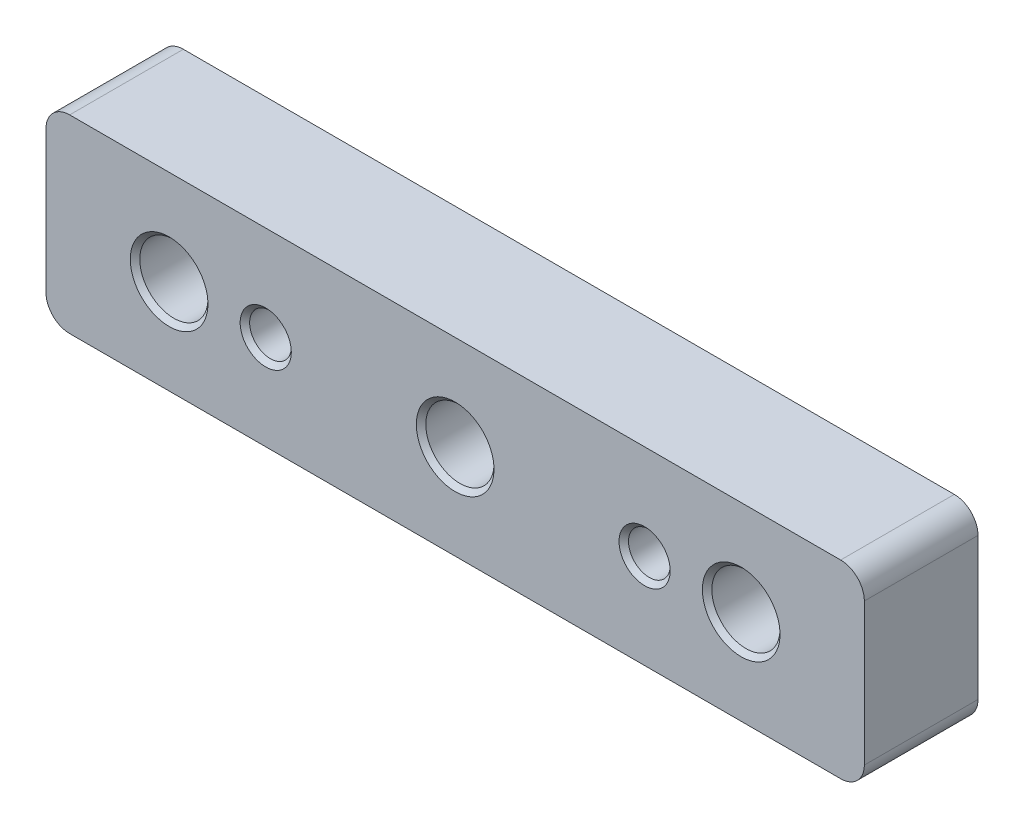
ISO-10303-21;
HEADER;
FILE_DESCRIPTION(('STEP AP214'),'2;1');
FILE_NAME('part.step','',(''),(''),'','','');
FILE_SCHEMA(('AUTOMOTIVE_DESIGN { 1 0 10303 214 1 1 1 1 }'));
ENDSEC;
DATA;
#1=APPLICATION_CONTEXT('core data for automotive mechanical design processes');
#2=APPLICATION_PROTOCOL_DEFINITION('international standard','automotive_design',2000,#1);
#3=PRODUCT_CONTEXT('',#1,'mechanical');
#4=PRODUCT('Part','Part','',(#3));
#5=PRODUCT_RELATED_PRODUCT_CATEGORY('part','',(#4));
#6=PRODUCT_DEFINITION_FORMATION('','',#4);
#7=PRODUCT_DEFINITION_CONTEXT('part definition',#1,'design');
#8=PRODUCT_DEFINITION('design','',#6,#7);
#9=PRODUCT_DEFINITION_SHAPE('','',#8);
#10=(LENGTH_UNIT() NAMED_UNIT(*) SI_UNIT(.MILLI.,.METRE.));
#11=(NAMED_UNIT(*) PLANE_ANGLE_UNIT() SI_UNIT($,.RADIAN.));
#12=(NAMED_UNIT(*) SI_UNIT($,.STERADIAN.) SOLID_ANGLE_UNIT());
#13=UNCERTAINTY_MEASURE_WITH_UNIT(LENGTH_MEASURE(1.E-05),#10,'distance_accuracy_value','');
#14=(GEOMETRIC_REPRESENTATION_CONTEXT(3) GLOBAL_UNCERTAINTY_ASSIGNED_CONTEXT((#13)) GLOBAL_UNIT_ASSIGNED_CONTEXT((#10,
#11,#12)) REPRESENTATION_CONTEXT('',''));
#15=CARTESIAN_POINT('',(0.,0.,0.));
#16=DIRECTION('',(0.,0.,1.));
#17=DIRECTION('',(1.,0.,0.));
#18=AXIS2_PLACEMENT_3D('',#15,#16,#17);
#19=CARTESIAN_POINT('',(39.1232060070326,9.9696844118921,5.10751094142825));
#20=DIRECTION('',(0.,0.,-1.));
#21=DIRECTION('',(-1.,0.,0.));
#22=AXIS2_PLACEMENT_3D('',#19,#20,#21);
#23=PLANE('',#22);
#24=CARTESIAN_POINT('',(28.6232060070326,2.4696844118921,5.10751094142825));
#25=DIRECTION('',(0.,0.,-1.));
#26=DIRECTION('',(-1.,0.,0.));
#27=AXIS2_PLACEMENT_3D('',#24,#25,#26);
#28=CIRCLE('',#27,4.10000000000002);
#29=CARTESIAN_POINT('',(24.5232060070326,2.4696844118921,5.10751094142825));
#30=VERTEX_POINT('',#29);
#31=EDGE_CURVE('E10',#30,#30,#28,.T.);
#32=ORIENTED_EDGE('',*,*,#31,.T.);
#33=EDGE_LOOP('',(#32));
#34=FACE_BOUND('',#33,.T.);
#35=CARTESIAN_POINT('',(-1.5767939929674,2.4696844118921,5.10751094142825));
#36=DIRECTION('',(0.,0.,-1.));
#37=DIRECTION('',(-1.,0.,0.));
#38=AXIS2_PLACEMENT_3D('',#35,#36,#37);
#39=CIRCLE('',#38,4.10000000000002);
#40=CARTESIAN_POINT('',(-5.67679399296742,2.4696844118921,5.10751094142825));
#41=VERTEX_POINT('',#40);
#42=EDGE_CURVE('E25',#41,#41,#39,.T.);
#43=ORIENTED_EDGE('',*,*,#42,.T.);
#44=EDGE_LOOP('',(#43));
#45=FACE_BOUND('',#44,.T.);
#46=CARTESIAN_POINT('',(-31.7767939929674,2.4696844118921,5.10751094142825));
#47=DIRECTION('',(0.,0.,-1.));
#48=DIRECTION('',(-1.,0.,0.));
#49=AXIS2_PLACEMENT_3D('',#46,#47,#48);
#50=CIRCLE('',#49,4.10000000000002);
#51=CARTESIAN_POINT('',(-35.8767939929674,2.4696844118921,5.10751094142825));
#52=VERTEX_POINT('',#51);
#53=EDGE_CURVE('E182',#52,#52,#50,.T.);
#54=ORIENTED_EDGE('',*,*,#53,.T.);
#55=EDGE_LOOP('',(#54));
#56=FACE_BOUND('',#55,.T.);
#57=CARTESIAN_POINT('',(-21.5767939929674,2.4696844118921,5.10751094142825));
#58=DIRECTION('',(0.,0.,1.));
#59=DIRECTION('',(1.,0.,0.));
#60=AXIS2_PLACEMENT_3D('',#57,#58,#59);
#61=CIRCLE('',#60,2.7);
#62=CARTESIAN_POINT('',(-18.8767939929674,2.4696844118921,5.10751094142825));
#63=VERTEX_POINT('',#62);
#64=EDGE_CURVE('E478',#63,#63,#61,.T.);
#65=ORIENTED_EDGE('',*,*,#64,.F.);
#66=EDGE_LOOP('',(#65));
#67=FACE_BOUND('',#66,.T.);
#68=CARTESIAN_POINT('',(18.4232060070326,2.4696844118921,5.10751094142825));
#69=DIRECTION('',(0.,0.,1.));
#70=DIRECTION('',(1.,0.,0.));
#71=AXIS2_PLACEMENT_3D('',#68,#69,#70);
#72=CIRCLE('',#71,2.7);
#73=CARTESIAN_POINT('',(21.1232060070326,2.4696844118921,5.10751094142825));
#74=VERTEX_POINT('',#73);
#75=EDGE_CURVE('E453',#74,#74,#72,.T.);
#76=ORIENTED_EDGE('',*,*,#75,.F.);
#77=EDGE_LOOP('',(#76));
#78=FACE_BOUND('',#77,.T.);
#79=CARTESIAN_POINT('',(39.1232060070326,9.9696844118921,5.10751094142825));
#80=DIRECTION('',(0.,0.,1.));
#81=DIRECTION('',(-1.,0.,0.));
#82=AXIS2_PLACEMENT_3D('',#79,#80,#81);
#83=CIRCLE('',#82,2.5);
#84=CARTESIAN_POINT('',(41.6232060070326,9.9696844118921,5.10751094142825));
#85=VERTEX_POINT('',#84);
#86=CARTESIAN_POINT('',(39.1232060070326,12.4696844118921,5.10751094142825));
#87=VERTEX_POINT('',#86);
#88=EDGE_CURVE('E128',#85,#87,#83,.T.);
#89=ORIENTED_EDGE('',*,*,#88,.T.);
#90=DIRECTION('',(-1.,0.,0.));
#91=VECTOR('',#90,1.);
#92=CARTESIAN_POINT('',(-42.2767939929674,12.4696844118921,5.10751094142825));
#93=LINE('',#92,#91);
#94=CARTESIAN_POINT('',(-42.2767939929674,12.4696844118921,5.10751094142825));
#95=VERTEX_POINT('',#94);
#96=EDGE_CURVE('E77',#87,#95,#93,.T.);
#97=ORIENTED_EDGE('',*,*,#96,.T.);
#98=CARTESIAN_POINT('',(-42.2767939929674,9.9696844118921,5.10751094142825));
#99=DIRECTION('',(0.,0.,1.));
#100=DIRECTION('',(-1.,0.,0.));
#101=AXIS2_PLACEMENT_3D('',#98,#99,#100);
#102=CIRCLE('',#101,2.5);
#103=CARTESIAN_POINT('',(-44.7767939929674,9.9696844118921,5.10751094142825));
#104=VERTEX_POINT('',#103);
#105=EDGE_CURVE('E462',#95,#104,#102,.T.);
#106=ORIENTED_EDGE('',*,*,#105,.T.);
#107=DIRECTION('',(0.,-1.,0.));
#108=VECTOR('',#107,1.);
#109=CARTESIAN_POINT('',(-44.7767939929674,9.9696844118921,5.10751094142825));
#110=LINE('',#109,#108);
#111=CARTESIAN_POINT('',(-44.7767939929674,-5.0303155881079,5.10751094142825));
#112=VERTEX_POINT('',#111);
#113=EDGE_CURVE('E464',#104,#112,#110,.T.);
#114=ORIENTED_EDGE('',*,*,#113,.T.);
#115=CARTESIAN_POINT('',(-42.2767939929674,-5.0303155881079,5.10751094142825));
#116=DIRECTION('',(0.,0.,1.));
#117=DIRECTION('',(-1.,0.,0.));
#118=AXIS2_PLACEMENT_3D('',#115,#116,#117);
#119=CIRCLE('',#118,2.5);
#120=CARTESIAN_POINT('',(-42.2767939929674,-7.5303155881079,5.10751094142825));
#121=VERTEX_POINT('',#120);
#122=EDGE_CURVE('E95',#112,#121,#119,.T.);
#123=ORIENTED_EDGE('',*,*,#122,.T.);
#124=DIRECTION('',(1.,0.,0.));
#125=VECTOR('',#124,1.);
#126=CARTESIAN_POINT('',(-42.2767939929674,-7.5303155881079,5.10751094142825));
#127=LINE('',#126,#125);
#128=CARTESIAN_POINT('',(39.1232060070326,-7.5303155881079,5.10751094142825));
#129=VERTEX_POINT('',#128);
#130=EDGE_CURVE('E90',#121,#129,#127,.T.);
#131=ORIENTED_EDGE('',*,*,#130,.T.);
#132=CARTESIAN_POINT('',(39.1232060070326,-5.0303155881079,5.10751094142825));
#133=DIRECTION('',(0.,0.,1.));
#134=DIRECTION('',(-1.,0.,0.));
#135=AXIS2_PLACEMENT_3D('',#132,#133,#134);
#136=CIRCLE('',#135,2.5);
#137=CARTESIAN_POINT('',(41.6232060070326,-5.03031558810789,5.10751094142825));
#138=VERTEX_POINT('',#137);
#139=EDGE_CURVE('E93',#129,#138,#136,.T.);
#140=ORIENTED_EDGE('',*,*,#139,.T.);
#141=DIRECTION('',(0.,1.,0.));
#142=VECTOR('',#141,1.);
#143=CARTESIAN_POINT('',(41.6232060070326,9.9696844118921,5.10751094142825));
#144=LINE('',#143,#142);
#145=EDGE_CURVE('E33',#138,#85,#144,.T.);
#146=ORIENTED_EDGE('',*,*,#145,.T.);
#147=EDGE_LOOP('',(#89,#97,#106,#114,#123,#131,#140,#146));
#148=FACE_BOUND('',#147,.T.);
#149=ADVANCED_FACE('F16',(#34,#45,#56,#67,#78,#148),#23,.F.);
#150=CARTESIAN_POINT('',(39.1232060070326,9.9696844118921,-6.89248905857175));
#151=DIRECTION('',(0.,0.,-1.));
#152=DIRECTION('',(-1.,0.,0.));
#153=AXIS2_PLACEMENT_3D('',#150,#151,#152);
#154=PLANE('',#153);
#155=CARTESIAN_POINT('',(-21.5767939929674,2.4696844118921,-6.89248905857175));
#156=DIRECTION('',(0.,0.,-1.));
#157=DIRECTION('',(-1.,0.,0.));
#158=AXIS2_PLACEMENT_3D('',#155,#156,#157);
#159=CIRCLE('',#158,2.69999999999997);
#160=CARTESIAN_POINT('',(-24.2767939929674,2.4696844118921,-6.89248905857175));
#161=VERTEX_POINT('',#160);
#162=EDGE_CURVE('E155',#161,#161,#159,.F.);
#163=ORIENTED_EDGE('',*,*,#162,.T.);
#164=EDGE_LOOP('',(#163));
#165=FACE_BOUND('',#164,.T.);
#166=CARTESIAN_POINT('',(18.4232060070326,2.4696844118921,-6.89248905857175));
#167=DIRECTION('',(0.,0.,-1.));
#168=DIRECTION('',(-1.,0.,0.));
#169=AXIS2_PLACEMENT_3D('',#166,#167,#168);
#170=CIRCLE('',#169,2.69999999999999);
#171=CARTESIAN_POINT('',(15.7232060070326,2.4696844118921,-6.89248905857175));
#172=VERTEX_POINT('',#171);
#173=EDGE_CURVE('E152',#172,#172,#170,.F.);
#174=ORIENTED_EDGE('',*,*,#173,.T.);
#175=EDGE_LOOP('',(#174));
#176=FACE_BOUND('',#175,.T.);
#177=CARTESIAN_POINT('',(28.6232060070326,2.4696844118921,-6.89248905857175));
#178=DIRECTION('',(0.,0.,-1.));
#179=DIRECTION('',(-1.,0.,0.));
#180=AXIS2_PLACEMENT_3D('',#177,#178,#179);
#181=CIRCLE('',#180,4.09999999999999);
#182=CARTESIAN_POINT('',(24.5232060070326,2.4696844118921,-6.89248905857175));
#183=VERTEX_POINT('',#182);
#184=EDGE_CURVE('E149',#183,#183,#181,.F.);
#185=ORIENTED_EDGE('',*,*,#184,.T.);
#186=EDGE_LOOP('',(#185));
#187=FACE_BOUND('',#186,.T.);
#188=CARTESIAN_POINT('',(-1.5767939929674,2.4696844118921,-6.89248905857175));
#189=DIRECTION('',(0.,0.,-1.));
#190=DIRECTION('',(-1.,0.,0.));
#191=AXIS2_PLACEMENT_3D('',#188,#189,#190);
#192=CIRCLE('',#191,4.09999999999999);
#193=CARTESIAN_POINT('',(-5.67679399296739,2.4696844118921,-6.89248905857175));
#194=VERTEX_POINT('',#193);
#195=EDGE_CURVE('E146',#194,#194,#192,.F.);
#196=ORIENTED_EDGE('',*,*,#195,.T.);
#197=EDGE_LOOP('',(#196));
#198=FACE_BOUND('',#197,.T.);
#199=CARTESIAN_POINT('',(-31.7767939929674,2.4696844118921,-6.89248905857175));
#200=DIRECTION('',(0.,0.,-1.));
#201=DIRECTION('',(-1.,0.,0.));
#202=AXIS2_PLACEMENT_3D('',#199,#200,#201);
#203=CIRCLE('',#202,4.09999999999999);
#204=CARTESIAN_POINT('',(-35.8767939929674,2.4696844118921,-6.89248905857175));
#205=VERTEX_POINT('',#204);
#206=EDGE_CURVE('E143',#205,#205,#203,.F.);
#207=ORIENTED_EDGE('',*,*,#206,.T.);
#208=EDGE_LOOP('',(#207));
#209=FACE_BOUND('',#208,.T.);
#210=CARTESIAN_POINT('',(39.1232060070326,9.9696844118921,-6.89248905857175));
#211=DIRECTION('',(0.,0.,1.));
#212=DIRECTION('',(-1.,0.,0.));
#213=AXIS2_PLACEMENT_3D('',#210,#211,#212);
#214=CIRCLE('',#213,2.5);
#215=CARTESIAN_POINT('',(41.6232060070326,9.9696844118921,-6.89248905857175));
#216=VERTEX_POINT('',#215);
#217=CARTESIAN_POINT('',(39.1232060070326,12.4696844118921,-6.89248905857175));
#218=VERTEX_POINT('',#217);
#219=EDGE_CURVE('E113',#216,#218,#214,.T.);
#220=ORIENTED_EDGE('',*,*,#219,.F.);
#221=DIRECTION('',(0.,1.,0.));
#222=VECTOR('',#221,1.);
#223=CARTESIAN_POINT('',(41.6232060070326,9.9696844118921,-6.89248905857175));
#224=LINE('',#223,#222);
#225=CARTESIAN_POINT('',(41.6232060070326,-5.03031558810789,-6.89248905857175));
#226=VERTEX_POINT('',#225);
#227=EDGE_CURVE('E68',#226,#216,#224,.T.);
#228=ORIENTED_EDGE('',*,*,#227,.F.);
#229=CARTESIAN_POINT('',(39.1232060070326,-5.0303155881079,-6.89248905857175));
#230=DIRECTION('',(0.,0.,1.));
#231=DIRECTION('',(-1.,0.,0.));
#232=AXIS2_PLACEMENT_3D('',#229,#230,#231);
#233=CIRCLE('',#232,2.5);
#234=CARTESIAN_POINT('',(39.1232060070326,-7.5303155881079,-6.89248905857175));
#235=VERTEX_POINT('',#234);
#236=EDGE_CURVE('E62',#235,#226,#233,.T.);
#237=ORIENTED_EDGE('',*,*,#236,.F.);
#238=DIRECTION('',(1.,0.,0.));
#239=VECTOR('',#238,1.);
#240=CARTESIAN_POINT('',(-42.2767939929674,-7.5303155881079,-6.89248905857175));
#241=LINE('',#240,#239);
#242=CARTESIAN_POINT('',(-42.2767939929674,-7.5303155881079,-6.89248905857175));
#243=VERTEX_POINT('',#242);
#244=EDGE_CURVE('E103',#243,#235,#241,.T.);
#245=ORIENTED_EDGE('',*,*,#244,.F.);
#246=CARTESIAN_POINT('',(-42.2767939929674,-5.0303155881079,-6.89248905857175));
#247=DIRECTION('',(0.,0.,1.));
#248=DIRECTION('',(-1.,0.,0.));
#249=AXIS2_PLACEMENT_3D('',#246,#247,#248);
#250=CIRCLE('',#249,2.5);
#251=CARTESIAN_POINT('',(-44.7767939929674,-5.0303155881079,-6.89248905857175));
#252=VERTEX_POINT('',#251);
#253=EDGE_CURVE('E123',#252,#243,#250,.T.);
#254=ORIENTED_EDGE('',*,*,#253,.F.);
#255=DIRECTION('',(0.,-1.,0.));
#256=VECTOR('',#255,1.);
#257=CARTESIAN_POINT('',(-44.7767939929674,9.9696844118921,-6.89248905857175));
#258=LINE('',#257,#256);
#259=CARTESIAN_POINT('',(-44.7767939929674,9.9696844118921,-6.89248905857175));
#260=VERTEX_POINT('',#259);
#261=EDGE_CURVE('E121',#260,#252,#258,.T.);
#262=ORIENTED_EDGE('',*,*,#261,.F.);
#263=CARTESIAN_POINT('',(-42.2767939929674,9.9696844118921,-6.89248905857175));
#264=DIRECTION('',(0.,0.,1.));
#265=DIRECTION('',(-1.,0.,0.));
#266=AXIS2_PLACEMENT_3D('',#263,#264,#265);
#267=CIRCLE('',#266,2.5);
#268=CARTESIAN_POINT('',(-42.2767939929674,12.4696844118921,-6.89248905857175));
#269=VERTEX_POINT('',#268);
#270=EDGE_CURVE('E119',#269,#260,#267,.T.);
#271=ORIENTED_EDGE('',*,*,#270,.F.);
#272=DIRECTION('',(-1.,0.,0.));
#273=VECTOR('',#272,1.);
#274=CARTESIAN_POINT('',(-42.2767939929674,12.4696844118921,-6.89248905857175));
#275=LINE('',#274,#273);
#276=EDGE_CURVE('E116',#218,#269,#275,.T.);
#277=ORIENTED_EDGE('',*,*,#276,.F.);
#278=EDGE_LOOP('',(#220,#228,#237,#245,#254,#262,#271,#277));
#279=FACE_BOUND('',#278,.T.);
#280=ADVANCED_FACE('F213',(#165,#176,#187,#198,#209,#279),#154,.T.);
#281=CARTESIAN_POINT('',(39.1232060070326,9.9696844118921,5.10751094142825));
#282=DIRECTION('',(0.,0.,-1.));
#283=DIRECTION('',(-1.,0.,0.));
#284=AXIS2_PLACEMENT_3D('',#281,#282,#283);
#285=CYLINDRICAL_SURFACE('',#284,2.5);
#286=ORIENTED_EDGE('',*,*,#219,.T.);
#287=DIRECTION('',(0.,0.,-1.));
#288=VECTOR('',#287,1.);
#289=CARTESIAN_POINT('',(39.1232060070326,12.4696844118921,5.10751094142825));
#290=LINE('',#289,#288);
#291=EDGE_CURVE('E141',#87,#218,#290,.T.);
#292=ORIENTED_EDGE('',*,*,#291,.F.);
#293=ORIENTED_EDGE('',*,*,#88,.F.);
#294=DIRECTION('',(0.,0.,-1.));
#295=VECTOR('',#294,1.);
#296=CARTESIAN_POINT('',(41.6232060070326,9.9696844118921,5.10751094142825));
#297=LINE('',#296,#295);
#298=EDGE_CURVE('E109',#85,#216,#297,.T.);
#299=ORIENTED_EDGE('',*,*,#298,.T.);
#300=EDGE_LOOP('',(#286,#292,#293,#299));
#301=FACE_BOUND('',#300,.T.);
#302=ADVANCED_FACE('F219',(#301),#285,.T.);
#303=CARTESIAN_POINT('',(-42.2767939929674,12.4696844118921,5.10751094142825));
#304=DIRECTION('',(0.,-1.,0.));
#305=DIRECTION('',(0.,0.,-1.));
#306=AXIS2_PLACEMENT_3D('',#303,#304,#305);
#307=PLANE('',#306);
#308=ORIENTED_EDGE('',*,*,#276,.T.);
#309=DIRECTION('',(0.,0.,-1.));
#310=VECTOR('',#309,1.);
#311=CARTESIAN_POINT('',(-42.2767939929674,12.4696844118921,5.10751094142825));
#312=LINE('',#311,#310);
#313=EDGE_CURVE('E138',#95,#269,#312,.T.);
#314=ORIENTED_EDGE('',*,*,#313,.F.);
#315=ORIENTED_EDGE('',*,*,#96,.F.);
#316=ORIENTED_EDGE('',*,*,#291,.T.);
#317=EDGE_LOOP('',(#308,#314,#315,#316));
#318=FACE_BOUND('',#317,.T.);
#319=ADVANCED_FACE('F240',(#318),#307,.F.);
#320=CARTESIAN_POINT('',(-42.2767939929674,9.9696844118921,5.10751094142825));
#321=DIRECTION('',(0.,0.,-1.));
#322=DIRECTION('',(-1.,0.,0.));
#323=AXIS2_PLACEMENT_3D('',#320,#321,#322);
#324=CYLINDRICAL_SURFACE('',#323,2.5);
#325=ORIENTED_EDGE('',*,*,#270,.T.);
#326=DIRECTION('',(0.,0.,-1.));
#327=VECTOR('',#326,1.);
#328=CARTESIAN_POINT('',(-44.7767939929674,9.9696844118921,5.10751094142825));
#329=LINE('',#328,#327);
#330=EDGE_CURVE('E135',#104,#260,#329,.T.);
#331=ORIENTED_EDGE('',*,*,#330,.F.);
#332=ORIENTED_EDGE('',*,*,#105,.F.);
#333=ORIENTED_EDGE('',*,*,#313,.T.);
#334=EDGE_LOOP('',(#325,#331,#332,#333));
#335=FACE_BOUND('',#334,.T.);
#336=ADVANCED_FACE('F236',(#335),#324,.T.);
#337=CARTESIAN_POINT('',(-44.7767939929674,9.9696844118921,5.10751094142825));
#338=DIRECTION('',(1.,0.,0.));
#339=DIRECTION('',(0.,0.,-1.));
#340=AXIS2_PLACEMENT_3D('',#337,#338,#339);
#341=PLANE('',#340);
#342=ORIENTED_EDGE('',*,*,#261,.T.);
#343=DIRECTION('',(0.,0.,-1.));
#344=VECTOR('',#343,1.);
#345=CARTESIAN_POINT('',(-44.7767939929674,-5.0303155881079,5.10751094142825));
#346=LINE('',#345,#344);
#347=EDGE_CURVE('E132',#112,#252,#346,.T.);
#348=ORIENTED_EDGE('',*,*,#347,.F.);
#349=ORIENTED_EDGE('',*,*,#113,.F.);
#350=ORIENTED_EDGE('',*,*,#330,.T.);
#351=EDGE_LOOP('',(#342,#348,#349,#350));
#352=FACE_BOUND('',#351,.T.);
#353=ADVANCED_FACE('F232',(#352),#341,.F.);
#354=CARTESIAN_POINT('',(-42.2767939929674,-5.0303155881079,5.10751094142825));
#355=DIRECTION('',(0.,0.,-1.));
#356=DIRECTION('',(-1.,0.,0.));
#357=AXIS2_PLACEMENT_3D('',#354,#355,#356);
#358=CYLINDRICAL_SURFACE('',#357,2.5);
#359=ORIENTED_EDGE('',*,*,#253,.T.);
#360=DIRECTION('',(0.,0.,-1.));
#361=VECTOR('',#360,1.);
#362=CARTESIAN_POINT('',(-42.2767939929674,-7.5303155881079,5.10751094142825));
#363=LINE('',#362,#361);
#364=EDGE_CURVE('E104',#121,#243,#363,.T.);
#365=ORIENTED_EDGE('',*,*,#364,.F.);
#366=ORIENTED_EDGE('',*,*,#122,.F.);
#367=ORIENTED_EDGE('',*,*,#347,.T.);
#368=EDGE_LOOP('',(#359,#365,#366,#367));
#369=FACE_BOUND('',#368,.T.);
#370=ADVANCED_FACE('F229',(#369),#358,.T.);
#371=CARTESIAN_POINT('',(-42.2767939929674,-7.5303155881079,5.10751094142825));
#372=DIRECTION('',(0.,1.,0.));
#373=DIRECTION('',(0.,0.,1.));
#374=AXIS2_PLACEMENT_3D('',#371,#372,#373);
#375=PLANE('',#374);
#376=ORIENTED_EDGE('',*,*,#244,.T.);
#377=DIRECTION('',(0.,0.,-1.));
#378=VECTOR('',#377,1.);
#379=CARTESIAN_POINT('',(39.1232060070326,-7.5303155881079,5.10751094142825));
#380=LINE('',#379,#378);
#381=EDGE_CURVE('E100',#129,#235,#380,.T.);
#382=ORIENTED_EDGE('',*,*,#381,.F.);
#383=ORIENTED_EDGE('',*,*,#130,.F.);
#384=ORIENTED_EDGE('',*,*,#364,.T.);
#385=EDGE_LOOP('',(#376,#382,#383,#384));
#386=FACE_BOUND('',#385,.T.);
#387=ADVANCED_FACE('F101',(#386),#375,.F.);
#388=CARTESIAN_POINT('',(39.1232060070326,-5.0303155881079,5.10751094142825));
#389=DIRECTION('',(0.,0.,-1.));
#390=DIRECTION('',(-1.,0.,0.));
#391=AXIS2_PLACEMENT_3D('',#388,#389,#390);
#392=CYLINDRICAL_SURFACE('',#391,2.5);
#393=ORIENTED_EDGE('',*,*,#236,.T.);
#394=DIRECTION('',(0.,0.,-1.));
#395=VECTOR('',#394,1.);
#396=CARTESIAN_POINT('',(41.6232060070326,-5.03031558810789,5.10751094142825));
#397=LINE('',#396,#395);
#398=EDGE_CURVE('E105',#138,#226,#397,.T.);
#399=ORIENTED_EDGE('',*,*,#398,.F.);
#400=ORIENTED_EDGE('',*,*,#139,.F.);
#401=ORIENTED_EDGE('',*,*,#381,.T.);
#402=EDGE_LOOP('',(#393,#399,#400,#401));
#403=FACE_BOUND('',#402,.T.);
#404=ADVANCED_FACE('F107',(#403),#392,.T.);
#405=CARTESIAN_POINT('',(41.6232060070326,9.9696844118921,5.10751094142825));
#406=DIRECTION('',(-1.,0.,0.));
#407=DIRECTION('',(0.,0.,1.));
#408=AXIS2_PLACEMENT_3D('',#405,#406,#407);
#409=PLANE('',#408);
#410=ORIENTED_EDGE('',*,*,#227,.T.);
#411=ORIENTED_EDGE('',*,*,#298,.F.);
#412=ORIENTED_EDGE('',*,*,#145,.F.);
#413=ORIENTED_EDGE('',*,*,#398,.T.);
#414=EDGE_LOOP('',(#410,#411,#412,#413));
#415=FACE_BOUND('',#414,.T.);
#416=ADVANCED_FACE('F209',(#415),#409,.F.);
#417=CARTESIAN_POINT('',(28.6232060070326,2.4696844118921,5.10751094142825));
#418=DIRECTION('',(0.,0.,-1.));
#419=DIRECTION('',(-1.,0.,0.));
#420=AXIS2_PLACEMENT_3D('',#417,#418,#419);
#421=CYLINDRICAL_SURFACE('',#420,3.6);
#422=CARTESIAN_POINT('',(28.6232060070326,2.4696844118921,-6.39248905857176));
#423=DIRECTION('',(0.,0.,-1.));
#424=DIRECTION('',(-1.,0.,0.));
#425=AXIS2_PLACEMENT_3D('',#422,#423,#424);
#426=CIRCLE('',#425,3.6);
#427=CARTESIAN_POINT('',(25.0232060070326,2.4696844118921,-6.39248905857176));
#428=VERTEX_POINT('',#427);
#429=EDGE_CURVE('E167',#428,#428,#426,.T.);
#430=ORIENTED_EDGE('',*,*,#429,.T.);
#431=EDGE_LOOP('',(#430));
#432=FACE_BOUND('',#431,.T.);
#433=CARTESIAN_POINT('',(28.6232060070326,2.4696844118921,4.60751094142823));
#434=DIRECTION('',(0.,0.,-1.));
#435=DIRECTION('',(-1.,0.,0.));
#436=AXIS2_PLACEMENT_3D('',#433,#434,#435);
#437=CIRCLE('',#436,3.6);
#438=CARTESIAN_POINT('',(25.0232060070326,2.4696844118921,4.60751094142823));
#439=VERTEX_POINT('',#438);
#440=EDGE_CURVE('E164',#439,#439,#437,.F.);
#441=ORIENTED_EDGE('',*,*,#440,.T.);
#442=EDGE_LOOP('',(#441));
#443=FACE_BOUND('',#442,.T.);
#444=ADVANCED_FACE('F198',(#432,#443),#421,.F.);
#445=CARTESIAN_POINT('',(-1.5767939929674,2.4696844118921,5.10751094142825));
#446=DIRECTION('',(0.,0.,-1.));
#447=DIRECTION('',(-1.,0.,0.));
#448=AXIS2_PLACEMENT_3D('',#445,#446,#447);
#449=CYLINDRICAL_SURFACE('',#448,3.6);
#450=CARTESIAN_POINT('',(-1.5767939929674,2.4696844118921,-6.39248905857176));
#451=DIRECTION('',(0.,0.,-1.));
#452=DIRECTION('',(-1.,0.,0.));
#453=AXIS2_PLACEMENT_3D('',#450,#451,#452);
#454=CIRCLE('',#453,3.6);
#455=CARTESIAN_POINT('',(-5.1767939929674,2.4696844118921,-6.39248905857176));
#456=VERTEX_POINT('',#455);
#457=EDGE_CURVE('E173',#456,#456,#454,.T.);
#458=ORIENTED_EDGE('',*,*,#457,.T.);
#459=EDGE_LOOP('',(#458));
#460=FACE_BOUND('',#459,.T.);
#461=CARTESIAN_POINT('',(-1.5767939929674,2.4696844118921,4.60751094142821));
#462=DIRECTION('',(0.,0.,-1.));
#463=DIRECTION('',(-1.,0.,0.));
#464=AXIS2_PLACEMENT_3D('',#461,#462,#463);
#465=CIRCLE('',#464,3.6);
#466=CARTESIAN_POINT('',(-5.1767939929674,2.4696844118921,4.60751094142821));
#467=VERTEX_POINT('',#466);
#468=EDGE_CURVE('E170',#467,#467,#465,.F.);
#469=ORIENTED_EDGE('',*,*,#468,.T.);
#470=EDGE_LOOP('',(#469));
#471=FACE_BOUND('',#470,.T.);
#472=ADVANCED_FACE('F195',(#460,#471),#449,.F.);
#473=CARTESIAN_POINT('',(-31.7767939929674,2.4696844118921,5.10751094142825));
#474=DIRECTION('',(0.,0.,-1.));
#475=DIRECTION('',(-1.,0.,0.));
#476=AXIS2_PLACEMENT_3D('',#473,#474,#475);
#477=CYLINDRICAL_SURFACE('',#476,3.6);
#478=CARTESIAN_POINT('',(-31.7767939929674,2.4696844118921,-6.39248905857176));
#479=DIRECTION('',(0.,0.,-1.));
#480=DIRECTION('',(-1.,0.,0.));
#481=AXIS2_PLACEMENT_3D('',#478,#479,#480);
#482=CIRCLE('',#481,3.6);
#483=CARTESIAN_POINT('',(-35.3767939929674,2.4696844118921,-6.39248905857176));
#484=VERTEX_POINT('',#483);
#485=EDGE_CURVE('E179',#484,#484,#482,.T.);
#486=ORIENTED_EDGE('',*,*,#485,.T.);
#487=EDGE_LOOP('',(#486));
#488=FACE_BOUND('',#487,.T.);
#489=CARTESIAN_POINT('',(-31.7767939929674,2.4696844118921,4.60751094142821));
#490=DIRECTION('',(0.,0.,-1.));
#491=DIRECTION('',(-1.,0.,0.));
#492=AXIS2_PLACEMENT_3D('',#489,#490,#491);
#493=CIRCLE('',#492,3.6);
#494=CARTESIAN_POINT('',(-35.3767939929674,2.4696844118921,4.60751094142821));
#495=VERTEX_POINT('',#494);
#496=EDGE_CURVE('E176',#495,#495,#493,.F.);
#497=ORIENTED_EDGE('',*,*,#496,.T.);
#498=EDGE_LOOP('',(#497));
#499=FACE_BOUND('',#498,.T.);
#500=ADVANCED_FACE('F197',(#488,#499),#477,.F.);
#501=CARTESIAN_POINT('',(18.4232060070326,2.4696844118921,5.10751094142825));
#502=DIRECTION('',(0.,0.,1.));
#503=DIRECTION('',(1.,0.,0.));
#504=AXIS2_PLACEMENT_3D('',#501,#502,#503);
#505=CYLINDRICAL_SURFACE('',#504,2.2);
#506=CARTESIAN_POINT('',(18.4232060070326,2.4696844118921,-6.39248905857175));
#507=DIRECTION('',(0.,0.,-1.));
#508=DIRECTION('',(-1.,0.,0.));
#509=AXIS2_PLACEMENT_3D('',#506,#507,#508);
#510=CIRCLE('',#509,2.2);
#511=CARTESIAN_POINT('',(16.2232060070326,2.4696844118921,-6.39248905857175));
#512=VERTEX_POINT('',#511);
#513=EDGE_CURVE('E161',#512,#512,#510,.T.);
#514=ORIENTED_EDGE('',*,*,#513,.T.);
#515=EDGE_LOOP('',(#514));
#516=FACE_BOUND('',#515,.T.);
#517=CARTESIAN_POINT('',(18.4232060070326,2.4696844118921,4.60751094142825));
#518=DIRECTION('',(0.,0.,1.));
#519=DIRECTION('',(1.,0.,0.));
#520=AXIS2_PLACEMENT_3D('',#517,#518,#519);
#521=CIRCLE('',#520,2.2);
#522=CARTESIAN_POINT('',(20.6232060070326,2.4696844118921,4.60751094142825));
#523=VERTEX_POINT('',#522);
#524=EDGE_CURVE('E117',#523,#523,#521,.T.);
#525=ORIENTED_EDGE('',*,*,#524,.T.);
#526=EDGE_LOOP('',(#525));
#527=FACE_BOUND('',#526,.T.);
#528=ADVANCED_FACE('F206',(#516,#527),#505,.F.);
#529=CARTESIAN_POINT('',(18.4232060070326,2.4696844118921,5.10751094142825));
#530=DIRECTION('',(0.,0.,1.));
#531=DIRECTION('',(1.,0.,0.));
#532=AXIS2_PLACEMENT_3D('',#529,#530,#531);
#533=CONICAL_SURFACE('',#532,2.7,0.785398163397452);
#534=ORIENTED_EDGE('',*,*,#524,.F.);
#535=EDGE_LOOP('',(#534));
#536=FACE_BOUND('',#535,.T.);
#537=ORIENTED_EDGE('',*,*,#75,.T.);
#538=EDGE_LOOP('',(#537));
#539=FACE_BOUND('',#538,.T.);
#540=ADVANCED_FACE('F342',(#536,#539),#533,.F.);
#541=CARTESIAN_POINT('',(-21.5767939929674,2.4696844118921,5.10751094142825));
#542=DIRECTION('',(0.,0.,1.));
#543=DIRECTION('',(1.,0.,0.));
#544=AXIS2_PLACEMENT_3D('',#541,#542,#543);
#545=CYLINDRICAL_SURFACE('',#544,2.2);
#546=CARTESIAN_POINT('',(-21.5767939929674,2.4696844118921,-6.39248905857177));
#547=DIRECTION('',(0.,0.,-1.));
#548=DIRECTION('',(-1.,0.,0.));
#549=AXIS2_PLACEMENT_3D('',#546,#547,#548);
#550=CIRCLE('',#549,2.2);
#551=CARTESIAN_POINT('',(-23.7767939929674,2.4696844118921,-6.39248905857177));
#552=VERTEX_POINT('',#551);
#553=EDGE_CURVE('E158',#552,#552,#550,.T.);
#554=ORIENTED_EDGE('',*,*,#553,.T.);
#555=EDGE_LOOP('',(#554));
#556=FACE_BOUND('',#555,.T.);
#557=CARTESIAN_POINT('',(-21.5767939929674,2.4696844118921,4.60751094142825));
#558=DIRECTION('',(0.,0.,1.));
#559=DIRECTION('',(1.,0.,0.));
#560=AXIS2_PLACEMENT_3D('',#557,#558,#559);
#561=CIRCLE('',#560,2.2);
#562=CARTESIAN_POINT('',(-19.3767939929674,2.4696844118921,4.60751094142825));
#563=VERTEX_POINT('',#562);
#564=EDGE_CURVE('E456',#563,#563,#561,.T.);
#565=ORIENTED_EDGE('',*,*,#564,.T.);
#566=EDGE_LOOP('',(#565));
#567=FACE_BOUND('',#566,.T.);
#568=ADVANCED_FACE('F333',(#556,#567),#545,.F.);
#569=CARTESIAN_POINT('',(-21.5767939929674,2.4696844118921,5.10751094142825));
#570=DIRECTION('',(0.,0.,1.));
#571=DIRECTION('',(1.,0.,0.));
#572=AXIS2_PLACEMENT_3D('',#569,#570,#571);
#573=CONICAL_SURFACE('',#572,2.7,0.785398163397452);
#574=ORIENTED_EDGE('',*,*,#564,.F.);
#575=EDGE_LOOP('',(#574));
#576=FACE_BOUND('',#575,.T.);
#577=ORIENTED_EDGE('',*,*,#64,.T.);
#578=EDGE_LOOP('',(#577));
#579=FACE_BOUND('',#578,.T.);
#580=ADVANCED_FACE('F251',(#576,#579),#573,.F.);
#581=CARTESIAN_POINT('',(-21.5767939929674,2.4696844118921,-6.89248905857175));
#582=DIRECTION('',(0.,0.,-1.));
#583=DIRECTION('',(-1.,0.,0.));
#584=AXIS2_PLACEMENT_3D('',#581,#582,#583);
#585=CONICAL_SURFACE('',#584,2.69999999999997,0.785398163397443);
#586=ORIENTED_EDGE('',*,*,#553,.F.);
#587=EDGE_LOOP('',(#586));
#588=FACE_BOUND('',#587,.T.);
#589=ORIENTED_EDGE('',*,*,#162,.F.);
#590=EDGE_LOOP('',(#589));
#591=FACE_BOUND('',#590,.T.);
#592=ADVANCED_FACE('F247',(#588,#591),#585,.F.);
#593=CARTESIAN_POINT('',(18.4232060070326,2.4696844118921,-6.89248905857175));
#594=DIRECTION('',(0.,0.,-1.));
#595=DIRECTION('',(-1.,0.,0.));
#596=AXIS2_PLACEMENT_3D('',#593,#594,#595);
#597=CONICAL_SURFACE('',#596,2.69999999999999,0.785398163397436);
#598=ORIENTED_EDGE('',*,*,#513,.F.);
#599=EDGE_LOOP('',(#598));
#600=FACE_BOUND('',#599,.T.);
#601=ORIENTED_EDGE('',*,*,#173,.F.);
#602=EDGE_LOOP('',(#601));
#603=FACE_BOUND('',#602,.T.);
#604=ADVANCED_FACE('F250',(#600,#603),#597,.F.);
#605=CARTESIAN_POINT('',(28.6232060070326,2.4696844118921,-6.89248905857175));
#606=DIRECTION('',(0.,0.,-1.));
#607=DIRECTION('',(-1.,0.,0.));
#608=AXIS2_PLACEMENT_3D('',#605,#606,#607);
#609=CONICAL_SURFACE('',#608,4.09999999999999,0.785398163397438);
#610=ORIENTED_EDGE('',*,*,#429,.F.);
#611=EDGE_LOOP('',(#610));
#612=FACE_BOUND('',#611,.T.);
#613=ORIENTED_EDGE('',*,*,#184,.F.);
#614=EDGE_LOOP('',(#613));
#615=FACE_BOUND('',#614,.T.);
#616=ADVANCED_FACE('F255',(#612,#615),#609,.F.);
#617=CARTESIAN_POINT('',(-1.5767939929674,2.4696844118921,-6.89248905857175));
#618=DIRECTION('',(0.,0.,-1.));
#619=DIRECTION('',(-1.,0.,0.));
#620=AXIS2_PLACEMENT_3D('',#617,#618,#619);
#621=CONICAL_SURFACE('',#620,4.09999999999999,0.785398163397447);
#622=ORIENTED_EDGE('',*,*,#457,.F.);
#623=EDGE_LOOP('',(#622));
#624=FACE_BOUND('',#623,.T.);
#625=ORIENTED_EDGE('',*,*,#195,.F.);
#626=EDGE_LOOP('',(#625));
#627=FACE_BOUND('',#626,.T.);
#628=ADVANCED_FACE('F259',(#624,#627),#621,.F.);
#629=CARTESIAN_POINT('',(-31.7767939929674,2.4696844118921,-6.89248905857175));
#630=DIRECTION('',(0.,0.,-1.));
#631=DIRECTION('',(-1.,0.,0.));
#632=AXIS2_PLACEMENT_3D('',#629,#630,#631);
#633=CONICAL_SURFACE('',#632,4.09999999999999,0.785398163397445);
#634=ORIENTED_EDGE('',*,*,#485,.F.);
#635=EDGE_LOOP('',(#634));
#636=FACE_BOUND('',#635,.T.);
#637=ORIENTED_EDGE('',*,*,#206,.F.);
#638=EDGE_LOOP('',(#637));
#639=FACE_BOUND('',#638,.T.);
#640=ADVANCED_FACE('F263',(#636,#639),#633,.F.);
#641=CARTESIAN_POINT('',(28.6232060070326,2.4696844118921,4.60751094142823));
#642=DIRECTION('',(0.,0.,1.));
#643=DIRECTION('',(1.,0.,0.));
#644=AXIS2_PLACEMENT_3D('',#641,#642,#643);
#645=CONICAL_SURFACE('',#644,3.6,0.78539816339745);
#646=ORIENTED_EDGE('',*,*,#31,.F.);
#647=EDGE_LOOP('',(#646));
#648=FACE_BOUND('',#647,.T.);
#649=ORIENTED_EDGE('',*,*,#440,.F.);
#650=EDGE_LOOP('',(#649));
#651=FACE_BOUND('',#650,.T.);
#652=ADVANCED_FACE('F192',(#648,#651),#645,.F.);
#653=CARTESIAN_POINT('',(-1.5767939929674,2.4696844118921,4.60751094142821));
#654=DIRECTION('',(0.,0.,1.));
#655=DIRECTION('',(1.,0.,0.));
#656=AXIS2_PLACEMENT_3D('',#653,#654,#655);
#657=CONICAL_SURFACE('',#656,3.6,0.785398163397435);
#658=ORIENTED_EDGE('',*,*,#42,.F.);
#659=EDGE_LOOP('',(#658));
#660=FACE_BOUND('',#659,.T.);
#661=ORIENTED_EDGE('',*,*,#468,.F.);
#662=EDGE_LOOP('',(#661));
#663=FACE_BOUND('',#662,.T.);
#664=ADVANCED_FACE('F189',(#660,#663),#657,.F.);
#665=CARTESIAN_POINT('',(-31.7767939929674,2.4696844118921,4.60751094142821));
#666=DIRECTION('',(0.,0.,1.));
#667=DIRECTION('',(1.,0.,0.));
#668=AXIS2_PLACEMENT_3D('',#665,#666,#667);
#669=CONICAL_SURFACE('',#668,3.6,0.785398163397436);
#670=ORIENTED_EDGE('',*,*,#53,.F.);
#671=EDGE_LOOP('',(#670));
#672=FACE_BOUND('',#671,.T.);
#673=ORIENTED_EDGE('',*,*,#496,.F.);
#674=EDGE_LOOP('',(#673));
#675=FACE_BOUND('',#674,.T.);
#676=ADVANCED_FACE('F18',(#672,#675),#669,.F.);
#677=CLOSED_SHELL('',(#149,#280,#302,#319,#336,#353,#370,#387,#404,#416,#444,#472,#500,#528,
#540,#568,#580,#592,#604,#616,#628,#640,#652,#664,#676));
#678=MANIFOLD_SOLID_BREP('B1',#677);
#679=ADVANCED_BREP_SHAPE_REPRESENTATION('',(#18,#678),#14);
#680=SHAPE_DEFINITION_REPRESENTATION(#9,#679);
ENDSEC;
END-ISO-10303-21;
